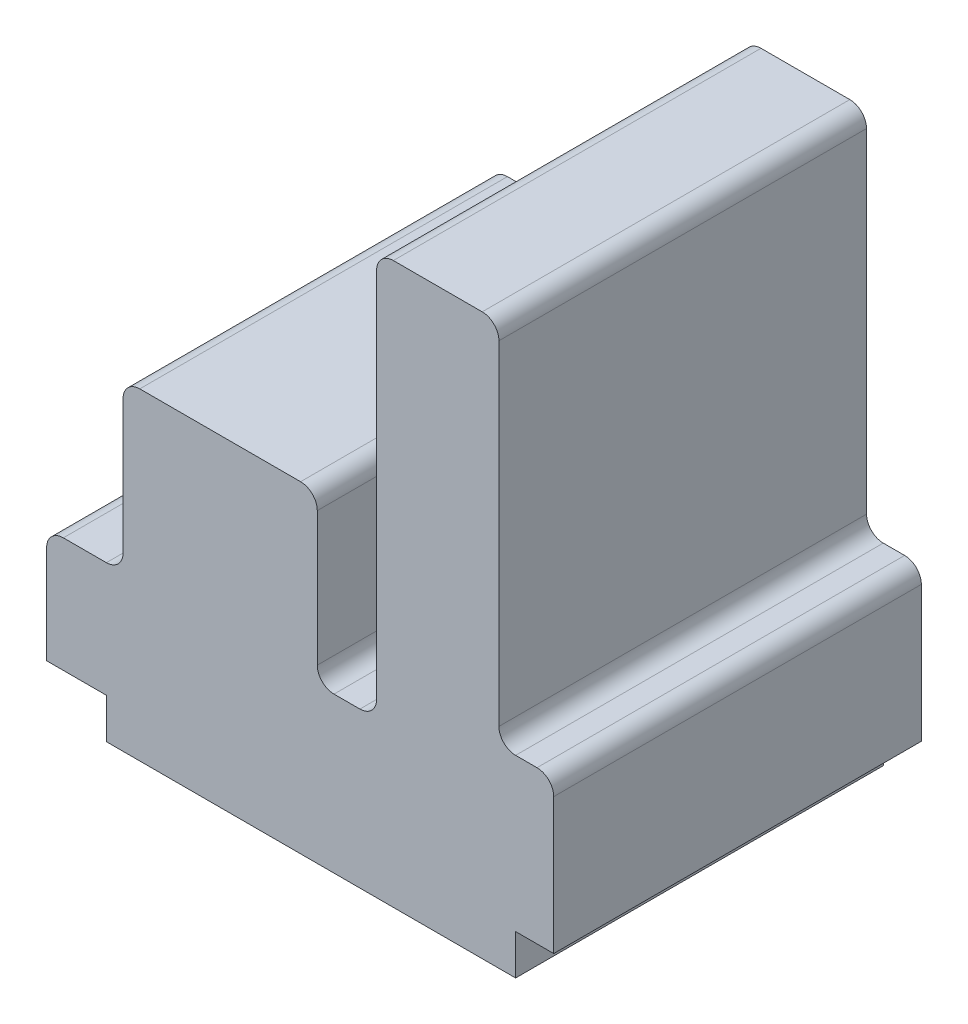
ISO-10303-21;
HEADER;
FILE_DESCRIPTION(('STEP AP214'),'2;1');
FILE_NAME('part.step','',(''),(''),'','','');
FILE_SCHEMA(('AUTOMOTIVE_DESIGN { 1 0 10303 214 1 1 1 1 }'));
ENDSEC;
DATA;
#1=APPLICATION_CONTEXT('core data for automotive mechanical design processes');
#2=APPLICATION_PROTOCOL_DEFINITION('international standard','automotive_design',2000,#1);
#3=PRODUCT_CONTEXT('',#1,'mechanical');
#4=PRODUCT('Part','Part','',(#3));
#5=PRODUCT_RELATED_PRODUCT_CATEGORY('part','',(#4));
#6=PRODUCT_DEFINITION_FORMATION('','',#4);
#7=PRODUCT_DEFINITION_CONTEXT('part definition',#1,'design');
#8=PRODUCT_DEFINITION('design','',#6,#7);
#9=PRODUCT_DEFINITION_SHAPE('','',#8);
#10=(LENGTH_UNIT() NAMED_UNIT(*) SI_UNIT(.MILLI.,.METRE.));
#11=(NAMED_UNIT(*) PLANE_ANGLE_UNIT() SI_UNIT($,.RADIAN.));
#12=(NAMED_UNIT(*) SI_UNIT($,.STERADIAN.) SOLID_ANGLE_UNIT());
#13=UNCERTAINTY_MEASURE_WITH_UNIT(LENGTH_MEASURE(1.E-05),#10,'distance_accuracy_value','');
#14=(GEOMETRIC_REPRESENTATION_CONTEXT(3) GLOBAL_UNCERTAINTY_ASSIGNED_CONTEXT((#13)) GLOBAL_UNIT_ASSIGNED_CONTEXT((#10,
#11,#12)) REPRESENTATION_CONTEXT('',''));
#15=CARTESIAN_POINT('',(0.,0.,0.));
#16=DIRECTION('',(0.,0.,1.));
#17=DIRECTION('',(1.,0.,0.));
#18=AXIS2_PLACEMENT_3D('',#15,#16,#17);
#19=CARTESIAN_POINT('',(0.,7.22031501674547,66.));
#20=DIRECTION('',(0.,1.,0.));
#21=DIRECTION('',(0.,0.,1.));
#22=AXIS2_PLACEMENT_3D('',#19,#20,#21);
#23=PLANE('',#22);
#24=DIRECTION('',(1.,0.,0.));
#25=VECTOR('',#24,1.);
#26=CARTESIAN_POINT('',(0.,7.22031501674547,0.));
#27=LINE('',#26,#25);
#28=CARTESIAN_POINT('',(0.,7.22031501674547,0.));
#29=VERTEX_POINT('',#28);
#30=CARTESIAN_POINT('',(10.7232772940344,7.22031501674547,0.));
#31=VERTEX_POINT('',#30);
#32=EDGE_CURVE('E237',#29,#31,#27,.T.);
#33=ORIENTED_EDGE('',*,*,#32,.T.);
#34=DIRECTION('',(0.,0.,-1.));
#35=VECTOR('',#34,1.);
#36=CARTESIAN_POINT('',(10.7232772940344,7.22031501674547,66.));
#37=LINE('',#36,#35);
#38=CARTESIAN_POINT('',(10.7232772940344,7.22031501674547,66.));
#39=VERTEX_POINT('',#38);
#40=EDGE_CURVE('E11',#39,#31,#37,.T.);
#41=ORIENTED_EDGE('',*,*,#40,.F.);
#42=DIRECTION('',(1.,0.,0.));
#43=VECTOR('',#42,1.);
#44=CARTESIAN_POINT('',(0.,7.22031501674547,66.));
#45=LINE('',#44,#43);
#46=CARTESIAN_POINT('',(0.,7.22031501674547,66.));
#47=VERTEX_POINT('',#46);
#48=EDGE_CURVE('E287',#47,#39,#45,.T.);
#49=ORIENTED_EDGE('',*,*,#48,.F.);
#50=DIRECTION('',(0.,0.,-1.));
#51=VECTOR('',#50,1.);
#52=CARTESIAN_POINT('',(0.,7.22031501674547,66.));
#53=LINE('',#52,#51);
#54=EDGE_CURVE('E233',#47,#29,#53,.T.);
#55=ORIENTED_EDGE('',*,*,#54,.T.);
#56=EDGE_LOOP('',(#33,#41,#49,#55));
#57=FACE_BOUND('',#56,.T.);
#58=ADVANCED_FACE('F33',(#57),#23,.F.);
#59=CARTESIAN_POINT('',(10.7232772940344,7.22031501674547,66.));
#60=DIRECTION('',(1.,0.,0.));
#61=DIRECTION('',(0.,1.,0.));
#62=AXIS2_PLACEMENT_3D('',#59,#60,#61);
#63=PLANE('',#62);
#64=DIRECTION('',(0.,-1.,0.));
#65=VECTOR('',#64,1.);
#66=CARTESIAN_POINT('',(10.7232772940344,7.22031501674547,0.));
#67=LINE('',#66,#65);
#68=CARTESIAN_POINT('',(10.7232772940344,0.,0.));
#69=VERTEX_POINT('',#68);
#70=EDGE_CURVE('E240',#31,#69,#67,.T.);
#71=ORIENTED_EDGE('',*,*,#70,.T.);
#72=DIRECTION('',(0.,0.,-1.));
#73=VECTOR('',#72,1.);
#74=CARTESIAN_POINT('',(10.7232772940344,0.,66.));
#75=LINE('',#74,#73);
#76=CARTESIAN_POINT('',(10.7232772940344,0.,66.));
#77=VERTEX_POINT('',#76);
#78=EDGE_CURVE('E41',#77,#69,#75,.T.);
#79=ORIENTED_EDGE('',*,*,#78,.F.);
#80=DIRECTION('',(0.,-1.,0.));
#81=VECTOR('',#80,1.);
#82=CARTESIAN_POINT('',(10.7232772940344,7.22031501674547,66.));
#83=LINE('',#82,#81);
#84=EDGE_CURVE('E146',#39,#77,#83,.T.);
#85=ORIENTED_EDGE('',*,*,#84,.F.);
#86=ORIENTED_EDGE('',*,*,#40,.T.);
#87=EDGE_LOOP('',(#71,#79,#85,#86));
#88=FACE_BOUND('',#87,.T.);
#89=ADVANCED_FACE('F435',(#88),#63,.F.);
#90=CARTESIAN_POINT('',(10.7232772940344,0.,66.));
#91=DIRECTION('',(0.,1.,0.));
#92=DIRECTION('',(0.,0.,1.));
#93=AXIS2_PLACEMENT_3D('',#90,#91,#92);
#94=PLANE('',#93);
#95=DIRECTION('',(1.,0.,0.));
#96=VECTOR('',#95,1.);
#97=CARTESIAN_POINT('',(10.7232772940344,0.,0.));
#98=LINE('',#97,#96);
#99=CARTESIAN_POINT('',(84.1934052714497,0.,0.));
#100=VERTEX_POINT('',#99);
#101=EDGE_CURVE('E242',#69,#100,#98,.T.);
#102=ORIENTED_EDGE('',*,*,#101,.T.);
#103=DIRECTION('',(0.,0.,-1.));
#104=VECTOR('',#103,1.);
#105=CARTESIAN_POINT('',(84.1934052714497,0.,66.));
#106=LINE('',#105,#104);
#107=CARTESIAN_POINT('',(84.1934052714497,0.,66.));
#108=VERTEX_POINT('',#107);
#109=EDGE_CURVE('E348',#108,#100,#106,.T.);
#110=ORIENTED_EDGE('',*,*,#109,.F.);
#111=DIRECTION('',(1.,0.,0.));
#112=VECTOR('',#111,1.);
#113=CARTESIAN_POINT('',(10.7232772940344,0.,66.));
#114=LINE('',#113,#112);
#115=EDGE_CURVE('E356',#77,#108,#114,.T.);
#116=ORIENTED_EDGE('',*,*,#115,.F.);
#117=ORIENTED_EDGE('',*,*,#78,.T.);
#118=EDGE_LOOP('',(#102,#110,#116,#117));
#119=FACE_BOUND('',#118,.T.);
#120=ADVANCED_FACE('F354',(#119),#94,.F.);
#121=CARTESIAN_POINT('',(84.1934052714498,7.22031501674547,66.));
#122=DIRECTION('',(-1.,0.,0.));
#123=DIRECTION('',(0.,-1.,0.));
#124=AXIS2_PLACEMENT_3D('',#121,#122,#123);
#125=PLANE('',#124);
#126=DIRECTION('',(0.,1.,0.));
#127=VECTOR('',#126,1.);
#128=CARTESIAN_POINT('',(84.1934052714498,7.22031501674547,0.));
#129=LINE('',#128,#127);
#130=CARTESIAN_POINT('',(84.1934052714498,7.22031501674547,0.));
#131=VERTEX_POINT('',#130);
#132=EDGE_CURVE('E244',#100,#131,#129,.T.);
#133=ORIENTED_EDGE('',*,*,#132,.T.);
#134=DIRECTION('',(0.,0.,-1.));
#135=VECTOR('',#134,1.);
#136=CARTESIAN_POINT('',(84.1934052714498,7.22031501674547,66.));
#137=LINE('',#136,#135);
#138=CARTESIAN_POINT('',(84.1934052714498,7.22031501674547,66.));
#139=VERTEX_POINT('',#138);
#140=EDGE_CURVE('E345',#139,#131,#137,.T.);
#141=ORIENTED_EDGE('',*,*,#140,.F.);
#142=DIRECTION('',(0.,1.,0.));
#143=VECTOR('',#142,1.);
#144=CARTESIAN_POINT('',(84.1934052714498,7.22031501674547,66.));
#145=LINE('',#144,#143);
#146=EDGE_CURVE('E374',#108,#139,#145,.T.);
#147=ORIENTED_EDGE('',*,*,#146,.F.);
#148=ORIENTED_EDGE('',*,*,#109,.T.);
#149=EDGE_LOOP('',(#133,#141,#147,#148));
#150=FACE_BOUND('',#149,.T.);
#151=ADVANCED_FACE('F365',(#150),#125,.F.);
#152=CARTESIAN_POINT('',(91.0332621944301,7.22031501674547,66.));
#153=DIRECTION('',(0.,1.,0.));
#154=DIRECTION('',(0.,0.,1.));
#155=AXIS2_PLACEMENT_3D('',#152,#153,#154);
#156=PLANE('',#155);
#157=DIRECTION('',(1.,0.,0.));
#158=VECTOR('',#157,1.);
#159=CARTESIAN_POINT('',(91.0332621944301,7.22031501674547,0.));
#160=LINE('',#159,#158);
#161=CARTESIAN_POINT('',(91.0332621944301,7.22031501674547,0.));
#162=VERTEX_POINT('',#161);
#163=EDGE_CURVE('E246',#131,#162,#160,.T.);
#164=ORIENTED_EDGE('',*,*,#163,.T.);
#165=DIRECTION('',(0.,0.,-1.));
#166=VECTOR('',#165,1.);
#167=CARTESIAN_POINT('',(91.0332621944301,7.22031501674547,66.));
#168=LINE('',#167,#166);
#169=CARTESIAN_POINT('',(91.0332621944301,7.22031501674547,66.));
#170=VERTEX_POINT('',#169);
#171=EDGE_CURVE('E342',#170,#162,#168,.T.);
#172=ORIENTED_EDGE('',*,*,#171,.F.);
#173=DIRECTION('',(1.,0.,0.));
#174=VECTOR('',#173,1.);
#175=CARTESIAN_POINT('',(91.0332621944301,7.22031501674547,66.));
#176=LINE('',#175,#174);
#177=EDGE_CURVE('E371',#139,#170,#176,.T.);
#178=ORIENTED_EDGE('',*,*,#177,.F.);
#179=ORIENTED_EDGE('',*,*,#140,.T.);
#180=EDGE_LOOP('',(#164,#172,#178,#179));
#181=FACE_BOUND('',#180,.T.);
#182=ADVANCED_FACE('F369',(#181),#156,.F.);
#183=CARTESIAN_POINT('',(91.0332621944301,7.22031501674547,66.));
#184=DIRECTION('',(-1.,0.,0.));
#185=DIRECTION('',(0.,0.,1.));
#186=AXIS2_PLACEMENT_3D('',#183,#184,#185);
#187=PLANE('',#186);
#188=DIRECTION('',(0.,1.,0.));
#189=VECTOR('',#188,1.);
#190=CARTESIAN_POINT('',(91.0332621944301,7.22031501674547,0.));
#191=LINE('',#190,#189);
#192=CARTESIAN_POINT('',(91.0332621944301,31.6171970900724,0.));
#193=VERTEX_POINT('',#192);
#194=EDGE_CURVE('E248',#162,#193,#191,.T.);
#195=ORIENTED_EDGE('',*,*,#194,.T.);
#196=DIRECTION('',(0.,0.,-1.));
#197=VECTOR('',#196,1.);
#198=CARTESIAN_POINT('',(91.0332621944301,31.6171970900724,66.));
#199=LINE('',#198,#197);
#200=CARTESIAN_POINT('',(91.0332621944301,31.6171970900724,66.));
#201=VERTEX_POINT('',#200);
#202=EDGE_CURVE('E339',#201,#193,#199,.T.);
#203=ORIENTED_EDGE('',*,*,#202,.F.);
#204=DIRECTION('',(0.,1.,0.));
#205=VECTOR('',#204,1.);
#206=CARTESIAN_POINT('',(91.0332621944301,7.22031501674547,66.));
#207=LINE('',#206,#205);
#208=EDGE_CURVE('E373',#170,#201,#207,.T.);
#209=ORIENTED_EDGE('',*,*,#208,.F.);
#210=ORIENTED_EDGE('',*,*,#171,.T.);
#211=EDGE_LOOP('',(#195,#203,#209,#210));
#212=FACE_BOUND('',#211,.T.);
#213=ADVANCED_FACE('F448',(#212),#187,.F.);
#214=CARTESIAN_POINT('',(88.0332621944301,31.6171970900724,66.));
#215=DIRECTION('',(0.,0.,-1.));
#216=DIRECTION('',(-1.,0.,0.));
#217=AXIS2_PLACEMENT_3D('',#214,#215,#216);
#218=CYLINDRICAL_SURFACE('',#217,3.);
#219=CARTESIAN_POINT('',(88.0332621944301,31.6171970900724,0.));
#220=DIRECTION('',(0.,0.,1.));
#221=DIRECTION('',(-1.,0.,0.));
#222=AXIS2_PLACEMENT_3D('',#219,#220,#221);
#223=CIRCLE('',#222,3.);
#224=CARTESIAN_POINT('',(88.0332621944301,34.6171970900724,0.));
#225=VERTEX_POINT('',#224);
#226=EDGE_CURVE('E250',#193,#225,#223,.T.);
#227=ORIENTED_EDGE('',*,*,#226,.T.);
#228=DIRECTION('',(0.,0.,-1.));
#229=VECTOR('',#228,1.);
#230=CARTESIAN_POINT('',(88.0332621944301,34.6171970900724,66.));
#231=LINE('',#230,#229);
#232=CARTESIAN_POINT('',(88.0332621944301,34.6171970900724,66.));
#233=VERTEX_POINT('',#232);
#234=EDGE_CURVE('E336',#233,#225,#231,.T.);
#235=ORIENTED_EDGE('',*,*,#234,.F.);
#236=CARTESIAN_POINT('',(88.0332621944301,31.6171970900724,66.));
#237=DIRECTION('',(0.,0.,1.));
#238=DIRECTION('',(-1.,0.,0.));
#239=AXIS2_PLACEMENT_3D('',#236,#237,#238);
#240=CIRCLE('',#239,3.);
#241=EDGE_CURVE('E376',#201,#233,#240,.T.);
#242=ORIENTED_EDGE('',*,*,#241,.F.);
#243=ORIENTED_EDGE('',*,*,#202,.T.);
#244=EDGE_LOOP('',(#227,#235,#242,#243));
#245=FACE_BOUND('',#244,.T.);
#246=ADVANCED_FACE('F451',(#245),#218,.T.);
#247=CARTESIAN_POINT('',(84.1934052714498,34.6171970900724,66.));
#248=DIRECTION('',(0.,-1.,0.));
#249=DIRECTION('',(0.,0.,-1.));
#250=AXIS2_PLACEMENT_3D('',#247,#248,#249);
#251=PLANE('',#250);
#252=DIRECTION('',(-1.,0.,0.));
#253=VECTOR('',#252,1.);
#254=CARTESIAN_POINT('',(84.1934052714498,34.6171970900724,0.));
#255=LINE('',#254,#253);
#256=CARTESIAN_POINT('',(84.1934052714498,34.6171970900724,0.));
#257=VERTEX_POINT('',#256);
#258=EDGE_CURVE('E252',#225,#257,#255,.T.);
#259=ORIENTED_EDGE('',*,*,#258,.T.);
#260=DIRECTION('',(0.,0.,-1.));
#261=VECTOR('',#260,1.);
#262=CARTESIAN_POINT('',(84.1934052714498,34.6171970900724,66.));
#263=LINE('',#262,#261);
#264=CARTESIAN_POINT('',(84.1934052714498,34.6171970900724,66.));
#265=VERTEX_POINT('',#264);
#266=EDGE_CURVE('E333',#265,#257,#263,.T.);
#267=ORIENTED_EDGE('',*,*,#266,.F.);
#268=DIRECTION('',(-1.,0.,0.));
#269=VECTOR('',#268,1.);
#270=CARTESIAN_POINT('',(84.1934052714498,34.6171970900724,66.));
#271=LINE('',#270,#269);
#272=EDGE_CURVE('E382',#233,#265,#271,.T.);
#273=ORIENTED_EDGE('',*,*,#272,.F.);
#274=ORIENTED_EDGE('',*,*,#234,.T.);
#275=EDGE_LOOP('',(#259,#267,#273,#274));
#276=FACE_BOUND('',#275,.T.);
#277=ADVANCED_FACE('F455',(#276),#251,.F.);
#278=CARTESIAN_POINT('',(84.1934052714497,37.6171970900724,66.));
#279=DIRECTION('',(0.,0.,-1.));
#280=DIRECTION('',(-1.,0.,0.));
#281=AXIS2_PLACEMENT_3D('',#278,#279,#280);
#282=CYLINDRICAL_SURFACE('',#281,3.);
#283=CARTESIAN_POINT('',(84.1934052714497,37.6171970900724,0.));
#284=DIRECTION('',(0.,0.,-1.));
#285=DIRECTION('',(1.,0.,0.));
#286=AXIS2_PLACEMENT_3D('',#283,#284,#285);
#287=CIRCLE('',#286,3.);
#288=CARTESIAN_POINT('',(81.1934052714497,37.6171970900725,0.));
#289=VERTEX_POINT('',#288);
#290=EDGE_CURVE('E254',#257,#289,#287,.T.);
#291=ORIENTED_EDGE('',*,*,#290,.T.);
#292=DIRECTION('',(0.,0.,-1.));
#293=VECTOR('',#292,1.);
#294=CARTESIAN_POINT('',(81.1934052714497,37.6171970900725,66.));
#295=LINE('',#294,#293);
#296=CARTESIAN_POINT('',(81.1934052714497,37.6171970900725,66.));
#297=VERTEX_POINT('',#296);
#298=EDGE_CURVE('E330',#297,#289,#295,.T.);
#299=ORIENTED_EDGE('',*,*,#298,.F.);
#300=CARTESIAN_POINT('',(84.1934052714497,37.6171970900724,66.));
#301=DIRECTION('',(0.,0.,-1.));
#302=DIRECTION('',(1.,0.,0.));
#303=AXIS2_PLACEMENT_3D('',#300,#301,#302);
#304=CIRCLE('',#303,3.);
#305=EDGE_CURVE('E384',#265,#297,#304,.T.);
#306=ORIENTED_EDGE('',*,*,#305,.F.);
#307=ORIENTED_EDGE('',*,*,#266,.T.);
#308=EDGE_LOOP('',(#291,#299,#306,#307));
#309=FACE_BOUND('',#308,.T.);
#310=ADVANCED_FACE('F459',(#309),#282,.F.);
#311=CARTESIAN_POINT('',(81.1934052714497,97.5716738581848,66.));
#312=DIRECTION('',(-1.,0.,0.));
#313=DIRECTION('',(0.,0.,1.));
#314=AXIS2_PLACEMENT_3D('',#311,#312,#313);
#315=PLANE('',#314);
#316=DIRECTION('',(0.,1.,0.));
#317=VECTOR('',#316,1.);
#318=CARTESIAN_POINT('',(81.1934052714497,97.5716738581848,0.));
#319=LINE('',#318,#317);
#320=CARTESIAN_POINT('',(81.1934052714497,97.5716738581848,0.));
#321=VERTEX_POINT('',#320);
#322=EDGE_CURVE('E256',#289,#321,#319,.T.);
#323=ORIENTED_EDGE('',*,*,#322,.T.);
#324=DIRECTION('',(0.,0.,-1.));
#325=VECTOR('',#324,1.);
#326=CARTESIAN_POINT('',(81.1934052714497,97.5716738581848,66.));
#327=LINE('',#326,#325);
#328=CARTESIAN_POINT('',(81.1934052714497,97.5716738581848,66.));
#329=VERTEX_POINT('',#328);
#330=EDGE_CURVE('E327',#329,#321,#327,.T.);
#331=ORIENTED_EDGE('',*,*,#330,.F.);
#332=DIRECTION('',(0.,1.,0.));
#333=VECTOR('',#332,1.);
#334=CARTESIAN_POINT('',(81.1934052714497,97.5716738581848,66.));
#335=LINE('',#334,#333);
#336=EDGE_CURVE('E386',#297,#329,#335,.T.);
#337=ORIENTED_EDGE('',*,*,#336,.F.);
#338=ORIENTED_EDGE('',*,*,#298,.T.);
#339=EDGE_LOOP('',(#323,#331,#337,#338));
#340=FACE_BOUND('',#339,.T.);
#341=ADVANCED_FACE('F463',(#340),#315,.F.);
#342=CARTESIAN_POINT('',(78.1934052714497,97.5716738581848,66.));
#343=DIRECTION('',(0.,0.,-1.));
#344=DIRECTION('',(-1.,0.,0.));
#345=AXIS2_PLACEMENT_3D('',#342,#343,#344);
#346=CYLINDRICAL_SURFACE('',#345,3.);
#347=CARTESIAN_POINT('',(78.1934052714497,97.5716738581848,0.));
#348=DIRECTION('',(0.,0.,1.));
#349=DIRECTION('',(1.,0.,0.));
#350=AXIS2_PLACEMENT_3D('',#347,#348,#349);
#351=CIRCLE('',#350,3.);
#352=CARTESIAN_POINT('',(78.1934052714497,100.571673858185,0.));
#353=VERTEX_POINT('',#352);
#354=EDGE_CURVE('E258',#321,#353,#351,.T.);
#355=ORIENTED_EDGE('',*,*,#354,.T.);
#356=DIRECTION('',(0.,0.,-1.));
#357=VECTOR('',#356,1.);
#358=CARTESIAN_POINT('',(78.1934052714497,100.571673858185,66.));
#359=LINE('',#358,#357);
#360=CARTESIAN_POINT('',(78.1934052714497,100.571673858185,66.));
#361=VERTEX_POINT('',#360);
#362=EDGE_CURVE('E324',#361,#353,#359,.T.);
#363=ORIENTED_EDGE('',*,*,#362,.F.);
#364=CARTESIAN_POINT('',(78.1934052714497,97.5716738581848,66.));
#365=DIRECTION('',(0.,0.,1.));
#366=DIRECTION('',(1.,0.,0.));
#367=AXIS2_PLACEMENT_3D('',#364,#365,#366);
#368=CIRCLE('',#367,3.);
#369=EDGE_CURVE('E388',#329,#361,#368,.T.);
#370=ORIENTED_EDGE('',*,*,#369,.F.);
#371=ORIENTED_EDGE('',*,*,#330,.T.);
#372=EDGE_LOOP('',(#355,#363,#370,#371));
#373=FACE_BOUND('',#372,.T.);
#374=ADVANCED_FACE('F467',(#373),#346,.T.);
#375=CARTESIAN_POINT('',(62.2414019103769,100.571673858185,66.));
#376=DIRECTION('',(0.,-1.,0.));
#377=DIRECTION('',(1.,0.,0.));
#378=AXIS2_PLACEMENT_3D('',#375,#376,#377);
#379=PLANE('',#378);
#380=DIRECTION('',(-1.,0.,0.));
#381=VECTOR('',#380,1.);
#382=CARTESIAN_POINT('',(62.2414019103769,100.571673858185,0.));
#383=LINE('',#382,#381);
#384=CARTESIAN_POINT('',(62.2414019103769,100.571673858185,0.));
#385=VERTEX_POINT('',#384);
#386=EDGE_CURVE('E260',#353,#385,#383,.T.);
#387=ORIENTED_EDGE('',*,*,#386,.T.);
#388=DIRECTION('',(0.,0.,-1.));
#389=VECTOR('',#388,1.);
#390=CARTESIAN_POINT('',(62.2414019103769,100.571673858185,66.));
#391=LINE('',#390,#389);
#392=CARTESIAN_POINT('',(62.2414019103769,100.571673858185,66.));
#393=VERTEX_POINT('',#392);
#394=EDGE_CURVE('E321',#393,#385,#391,.T.);
#395=ORIENTED_EDGE('',*,*,#394,.F.);
#396=DIRECTION('',(-1.,0.,0.));
#397=VECTOR('',#396,1.);
#398=CARTESIAN_POINT('',(62.2414019103769,100.571673858185,66.));
#399=LINE('',#398,#397);
#400=EDGE_CURVE('E390',#361,#393,#399,.T.);
#401=ORIENTED_EDGE('',*,*,#400,.F.);
#402=ORIENTED_EDGE('',*,*,#362,.T.);
#403=EDGE_LOOP('',(#387,#395,#401,#402));
#404=FACE_BOUND('',#403,.T.);
#405=ADVANCED_FACE('F471',(#404),#379,.F.);
#406=CARTESIAN_POINT('',(62.2414019103769,97.5716738581848,66.));
#407=DIRECTION('',(0.,0.,-1.));
#408=DIRECTION('',(-1.,0.,0.));
#409=AXIS2_PLACEMENT_3D('',#406,#407,#408);
#410=CYLINDRICAL_SURFACE('',#409,3.);
#411=CARTESIAN_POINT('',(62.2414019103769,97.5716738581848,0.));
#412=DIRECTION('',(0.,0.,1.));
#413=DIRECTION('',(-1.,0.,0.));
#414=AXIS2_PLACEMENT_3D('',#411,#412,#413);
#415=CIRCLE('',#414,3.);
#416=CARTESIAN_POINT('',(59.2414019103769,97.5716738581848,0.));
#417=VERTEX_POINT('',#416);
#418=EDGE_CURVE('E262',#385,#417,#415,.T.);
#419=ORIENTED_EDGE('',*,*,#418,.T.);
#420=DIRECTION('',(0.,0.,-1.));
#421=VECTOR('',#420,1.);
#422=CARTESIAN_POINT('',(59.2414019103769,97.5716738581848,66.));
#423=LINE('',#422,#421);
#424=CARTESIAN_POINT('',(59.2414019103769,97.5716738581848,66.));
#425=VERTEX_POINT('',#424);
#426=EDGE_CURVE('E318',#425,#417,#423,.T.);
#427=ORIENTED_EDGE('',*,*,#426,.F.);
#428=CARTESIAN_POINT('',(62.2414019103769,97.5716738581848,66.));
#429=DIRECTION('',(0.,0.,1.));
#430=DIRECTION('',(-1.,0.,0.));
#431=AXIS2_PLACEMENT_3D('',#428,#429,#430);
#432=CIRCLE('',#431,3.);
#433=EDGE_CURVE('E392',#393,#425,#432,.T.);
#434=ORIENTED_EDGE('',*,*,#433,.F.);
#435=ORIENTED_EDGE('',*,*,#394,.T.);
#436=EDGE_LOOP('',(#419,#427,#434,#435));
#437=FACE_BOUND('',#436,.T.);
#438=ADVANCED_FACE('F475',(#437),#410,.T.);
#439=CARTESIAN_POINT('',(59.2414019103769,30.837901934447,66.));
#440=DIRECTION('',(1.,0.,0.));
#441=DIRECTION('',(0.,1.,0.));
#442=AXIS2_PLACEMENT_3D('',#439,#440,#441);
#443=PLANE('',#442);
#444=DIRECTION('',(0.,-1.,0.));
#445=VECTOR('',#444,1.);
#446=CARTESIAN_POINT('',(59.2414019103769,30.837901934447,0.));
#447=LINE('',#446,#445);
#448=CARTESIAN_POINT('',(59.2414019103769,30.837901934447,0.));
#449=VERTEX_POINT('',#448);
#450=EDGE_CURVE('E264',#417,#449,#447,.T.);
#451=ORIENTED_EDGE('',*,*,#450,.T.);
#452=DIRECTION('',(0.,0.,-1.));
#453=VECTOR('',#452,1.);
#454=CARTESIAN_POINT('',(59.2414019103769,30.837901934447,66.));
#455=LINE('',#454,#453);
#456=CARTESIAN_POINT('',(59.2414019103769,30.837901934447,66.));
#457=VERTEX_POINT('',#456);
#458=EDGE_CURVE('E315',#457,#449,#455,.T.);
#459=ORIENTED_EDGE('',*,*,#458,.F.);
#460=DIRECTION('',(0.,-1.,0.));
#461=VECTOR('',#460,1.);
#462=CARTESIAN_POINT('',(59.2414019103769,30.837901934447,66.));
#463=LINE('',#462,#461);
#464=EDGE_CURVE('E394',#425,#457,#463,.T.);
#465=ORIENTED_EDGE('',*,*,#464,.F.);
#466=ORIENTED_EDGE('',*,*,#426,.T.);
#467=EDGE_LOOP('',(#451,#459,#465,#466));
#468=FACE_BOUND('',#467,.T.);
#469=ADVANCED_FACE('F479',(#468),#443,.F.);
#470=CARTESIAN_POINT('',(56.2414019103769,30.837901934447,66.));
#471=DIRECTION('',(0.,0.,-1.));
#472=DIRECTION('',(-1.,0.,0.));
#473=AXIS2_PLACEMENT_3D('',#470,#471,#472);
#474=CYLINDRICAL_SURFACE('',#473,3.);
#475=CARTESIAN_POINT('',(56.2414019103769,30.837901934447,0.));
#476=DIRECTION('',(0.,0.,-1.));
#477=DIRECTION('',(1.,0.,0.));
#478=AXIS2_PLACEMENT_3D('',#475,#476,#477);
#479=CIRCLE('',#478,3.);
#480=CARTESIAN_POINT('',(56.2414019103768,27.837901934447,0.));
#481=VERTEX_POINT('',#480);
#482=EDGE_CURVE('E266',#449,#481,#479,.T.);
#483=ORIENTED_EDGE('',*,*,#482,.T.);
#484=DIRECTION('',(0.,0.,-1.));
#485=VECTOR('',#484,1.);
#486=CARTESIAN_POINT('',(56.2414019103768,27.837901934447,66.));
#487=LINE('',#486,#485);
#488=CARTESIAN_POINT('',(56.2414019103768,27.837901934447,66.));
#489=VERTEX_POINT('',#488);
#490=EDGE_CURVE('E312',#489,#481,#487,.T.);
#491=ORIENTED_EDGE('',*,*,#490,.F.);
#492=CARTESIAN_POINT('',(56.2414019103769,30.837901934447,66.));
#493=DIRECTION('',(0.,0.,-1.));
#494=DIRECTION('',(1.,0.,0.));
#495=AXIS2_PLACEMENT_3D('',#492,#493,#494);
#496=CIRCLE('',#495,3.);
#497=EDGE_CURVE('E396',#457,#489,#496,.T.);
#498=ORIENTED_EDGE('',*,*,#497,.F.);
#499=ORIENTED_EDGE('',*,*,#458,.T.);
#500=EDGE_LOOP('',(#483,#491,#498,#499));
#501=FACE_BOUND('',#500,.T.);
#502=ADVANCED_FACE('F483',(#501),#474,.F.);
#503=CARTESIAN_POINT('',(51.5882238086797,27.837901934447,66.));
#504=DIRECTION('',(0.,-1.,0.));
#505=DIRECTION('',(0.,0.,-1.));
#506=AXIS2_PLACEMENT_3D('',#503,#504,#505);
#507=PLANE('',#506);
#508=DIRECTION('',(-1.,0.,0.));
#509=VECTOR('',#508,1.);
#510=CARTESIAN_POINT('',(51.5882238086797,27.837901934447,0.));
#511=LINE('',#510,#509);
#512=CARTESIAN_POINT('',(51.5882238086797,27.837901934447,0.));
#513=VERTEX_POINT('',#512);
#514=EDGE_CURVE('E268',#481,#513,#511,.T.);
#515=ORIENTED_EDGE('',*,*,#514,.T.);
#516=DIRECTION('',(0.,0.,-1.));
#517=VECTOR('',#516,1.);
#518=CARTESIAN_POINT('',(51.5882238086797,27.837901934447,66.));
#519=LINE('',#518,#517);
#520=CARTESIAN_POINT('',(51.5882238086797,27.837901934447,66.));
#521=VERTEX_POINT('',#520);
#522=EDGE_CURVE('E309',#521,#513,#519,.T.);
#523=ORIENTED_EDGE('',*,*,#522,.F.);
#524=DIRECTION('',(-1.,0.,0.));
#525=VECTOR('',#524,1.);
#526=CARTESIAN_POINT('',(51.5882238086797,27.837901934447,66.));
#527=LINE('',#526,#525);
#528=EDGE_CURVE('E398',#489,#521,#527,.T.);
#529=ORIENTED_EDGE('',*,*,#528,.F.);
#530=ORIENTED_EDGE('',*,*,#490,.T.);
#531=EDGE_LOOP('',(#515,#523,#529,#530));
#532=FACE_BOUND('',#531,.T.);
#533=ADVANCED_FACE('F487',(#532),#507,.F.);
#534=CARTESIAN_POINT('',(51.5882238086797,30.837901934447,66.));
#535=DIRECTION('',(0.,0.,-1.));
#536=DIRECTION('',(-1.,0.,0.));
#537=AXIS2_PLACEMENT_3D('',#534,#535,#536);
#538=CYLINDRICAL_SURFACE('',#537,3.);
#539=CARTESIAN_POINT('',(51.5882238086797,30.837901934447,0.));
#540=DIRECTION('',(0.,0.,-1.));
#541=DIRECTION('',(1.,0.,0.));
#542=AXIS2_PLACEMENT_3D('',#539,#540,#541);
#543=CIRCLE('',#542,3.);
#544=CARTESIAN_POINT('',(48.5882238086797,30.837901934447,0.));
#545=VERTEX_POINT('',#544);
#546=EDGE_CURVE('E270',#513,#545,#543,.T.);
#547=ORIENTED_EDGE('',*,*,#546,.T.);
#548=DIRECTION('',(0.,0.,-1.));
#549=VECTOR('',#548,1.);
#550=CARTESIAN_POINT('',(48.5882238086797,30.837901934447,66.));
#551=LINE('',#550,#549);
#552=CARTESIAN_POINT('',(48.5882238086797,30.837901934447,66.));
#553=VERTEX_POINT('',#552);
#554=EDGE_CURVE('E306',#553,#545,#551,.T.);
#555=ORIENTED_EDGE('',*,*,#554,.F.);
#556=CARTESIAN_POINT('',(51.5882238086797,30.837901934447,66.));
#557=DIRECTION('',(0.,0.,-1.));
#558=DIRECTION('',(1.,0.,0.));
#559=AXIS2_PLACEMENT_3D('',#556,#557,#558);
#560=CIRCLE('',#559,3.);
#561=EDGE_CURVE('E400',#521,#553,#560,.T.);
#562=ORIENTED_EDGE('',*,*,#561,.F.);
#563=ORIENTED_EDGE('',*,*,#522,.T.);
#564=EDGE_LOOP('',(#547,#555,#562,#563));
#565=FACE_BOUND('',#564,.T.);
#566=ADVANCED_FACE('F491',(#565),#538,.F.);
#567=CARTESIAN_POINT('',(48.5882238086797,54.8604947665026,66.));
#568=DIRECTION('',(-1.,0.,0.));
#569=DIRECTION('',(0.,0.,1.));
#570=AXIS2_PLACEMENT_3D('',#567,#568,#569);
#571=PLANE('',#570);
#572=DIRECTION('',(0.,1.,0.));
#573=VECTOR('',#572,1.);
#574=CARTESIAN_POINT('',(48.5882238086797,54.8604947665026,0.));
#575=LINE('',#574,#573);
#576=CARTESIAN_POINT('',(48.5882238086797,54.8604947665026,0.));
#577=VERTEX_POINT('',#576);
#578=EDGE_CURVE('E272',#545,#577,#575,.T.);
#579=ORIENTED_EDGE('',*,*,#578,.T.);
#580=DIRECTION('',(0.,0.,-1.));
#581=VECTOR('',#580,1.);
#582=CARTESIAN_POINT('',(48.5882238086797,54.8604947665026,66.));
#583=LINE('',#582,#581);
#584=CARTESIAN_POINT('',(48.5882238086797,54.8604947665026,66.));
#585=VERTEX_POINT('',#584);
#586=EDGE_CURVE('E303',#585,#577,#583,.T.);
#587=ORIENTED_EDGE('',*,*,#586,.F.);
#588=DIRECTION('',(0.,1.,0.));
#589=VECTOR('',#588,1.);
#590=CARTESIAN_POINT('',(48.5882238086797,54.8604947665026,66.));
#591=LINE('',#590,#589);
#592=EDGE_CURVE('E402',#553,#585,#591,.T.);
#593=ORIENTED_EDGE('',*,*,#592,.F.);
#594=ORIENTED_EDGE('',*,*,#554,.T.);
#595=EDGE_LOOP('',(#579,#587,#593,#594));
#596=FACE_BOUND('',#595,.T.);
#597=ADVANCED_FACE('F495',(#596),#571,.F.);
#598=CARTESIAN_POINT('',(45.5882238086797,54.8604947665026,66.));
#599=DIRECTION('',(0.,0.,-1.));
#600=DIRECTION('',(-1.,0.,0.));
#601=AXIS2_PLACEMENT_3D('',#598,#599,#600);
#602=CYLINDRICAL_SURFACE('',#601,3.);
#603=CARTESIAN_POINT('',(45.5882238086797,54.8604947665026,0.));
#604=DIRECTION('',(0.,0.,1.));
#605=DIRECTION('',(-1.,0.,0.));
#606=AXIS2_PLACEMENT_3D('',#603,#604,#605);
#607=CIRCLE('',#606,3.);
#608=CARTESIAN_POINT('',(45.5882238086797,57.8604947665026,0.));
#609=VERTEX_POINT('',#608);
#610=EDGE_CURVE('E274',#577,#609,#607,.T.);
#611=ORIENTED_EDGE('',*,*,#610,.T.);
#612=DIRECTION('',(0.,0.,-1.));
#613=VECTOR('',#612,1.);
#614=CARTESIAN_POINT('',(45.5882238086797,57.8604947665026,66.));
#615=LINE('',#614,#613);
#616=CARTESIAN_POINT('',(45.5882238086797,57.8604947665026,66.));
#617=VERTEX_POINT('',#616);
#618=EDGE_CURVE('E300',#617,#609,#615,.T.);
#619=ORIENTED_EDGE('',*,*,#618,.F.);
#620=CARTESIAN_POINT('',(45.5882238086797,54.8604947665026,66.));
#621=DIRECTION('',(0.,0.,1.));
#622=DIRECTION('',(-1.,0.,0.));
#623=AXIS2_PLACEMENT_3D('',#620,#621,#622);
#624=CIRCLE('',#623,3.);
#625=EDGE_CURVE('E404',#585,#617,#624,.T.);
#626=ORIENTED_EDGE('',*,*,#625,.F.);
#627=ORIENTED_EDGE('',*,*,#586,.T.);
#628=EDGE_LOOP('',(#611,#619,#626,#627));
#629=FACE_BOUND('',#628,.T.);
#630=ADVANCED_FACE('F499',(#629),#602,.T.);
#631=CARTESIAN_POINT('',(16.7232772940345,57.8604947665026,66.));
#632=DIRECTION('',(0.,-1.,0.));
#633=DIRECTION('',(0.,0.,-1.));
#634=AXIS2_PLACEMENT_3D('',#631,#632,#633);
#635=PLANE('',#634);
#636=DIRECTION('',(-1.,0.,0.));
#637=VECTOR('',#636,1.);
#638=CARTESIAN_POINT('',(16.7232772940345,57.8604947665026,0.));
#639=LINE('',#638,#637);
#640=CARTESIAN_POINT('',(16.7232772940345,57.8604947665026,0.));
#641=VERTEX_POINT('',#640);
#642=EDGE_CURVE('E276',#609,#641,#639,.T.);
#643=ORIENTED_EDGE('',*,*,#642,.T.);
#644=DIRECTION('',(0.,0.,-1.));
#645=VECTOR('',#644,1.);
#646=CARTESIAN_POINT('',(16.7232772940345,57.8604947665026,66.));
#647=LINE('',#646,#645);
#648=CARTESIAN_POINT('',(16.7232772940345,57.8604947665026,66.));
#649=VERTEX_POINT('',#648);
#650=EDGE_CURVE('E297',#649,#641,#647,.T.);
#651=ORIENTED_EDGE('',*,*,#650,.F.);
#652=DIRECTION('',(-1.,0.,0.));
#653=VECTOR('',#652,1.);
#654=CARTESIAN_POINT('',(16.7232772940345,57.8604947665026,66.));
#655=LINE('',#654,#653);
#656=EDGE_CURVE('E406',#617,#649,#655,.T.);
#657=ORIENTED_EDGE('',*,*,#656,.F.);
#658=ORIENTED_EDGE('',*,*,#618,.T.);
#659=EDGE_LOOP('',(#643,#651,#657,#658));
#660=FACE_BOUND('',#659,.T.);
#661=ADVANCED_FACE('F503',(#660),#635,.F.);
#662=CARTESIAN_POINT('',(16.7232772940345,54.8604947665026,66.));
#663=DIRECTION('',(0.,0.,-1.));
#664=DIRECTION('',(-1.,0.,0.));
#665=AXIS2_PLACEMENT_3D('',#662,#663,#664);
#666=CYLINDRICAL_SURFACE('',#665,3.);
#667=CARTESIAN_POINT('',(16.7232772940345,54.8604947665026,0.));
#668=DIRECTION('',(0.,0.,1.));
#669=DIRECTION('',(-1.,0.,0.));
#670=AXIS2_PLACEMENT_3D('',#667,#668,#669);
#671=CIRCLE('',#670,3.);
#672=CARTESIAN_POINT('',(13.7232772940345,54.8604947665026,0.));
#673=VERTEX_POINT('',#672);
#674=EDGE_CURVE('E278',#641,#673,#671,.T.);
#675=ORIENTED_EDGE('',*,*,#674,.T.);
#676=DIRECTION('',(0.,0.,-1.));
#677=VECTOR('',#676,1.);
#678=CARTESIAN_POINT('',(13.7232772940345,54.8604947665026,66.));
#679=LINE('',#678,#677);
#680=CARTESIAN_POINT('',(13.7232772940345,54.8604947665026,66.));
#681=VERTEX_POINT('',#680);
#682=EDGE_CURVE('E294',#681,#673,#679,.T.);
#683=ORIENTED_EDGE('',*,*,#682,.F.);
#684=CARTESIAN_POINT('',(16.7232772940345,54.8604947665026,66.));
#685=DIRECTION('',(0.,0.,1.));
#686=DIRECTION('',(-1.,0.,0.));
#687=AXIS2_PLACEMENT_3D('',#684,#685,#686);
#688=CIRCLE('',#687,3.);
#689=EDGE_CURVE('E408',#649,#681,#688,.T.);
#690=ORIENTED_EDGE('',*,*,#689,.F.);
#691=ORIENTED_EDGE('',*,*,#650,.T.);
#692=EDGE_LOOP('',(#675,#683,#690,#691));
#693=FACE_BOUND('',#692,.T.);
#694=ADVANCED_FACE('F507',(#693),#666,.T.);
#695=CARTESIAN_POINT('',(13.7232772940345,30.837901934447,66.));
#696=DIRECTION('',(1.,0.,0.));
#697=DIRECTION('',(0.,0.,-1.));
#698=AXIS2_PLACEMENT_3D('',#695,#696,#697);
#699=PLANE('',#698);
#700=DIRECTION('',(0.,-1.,0.));
#701=VECTOR('',#700,1.);
#702=CARTESIAN_POINT('',(13.7232772940345,30.837901934447,0.));
#703=LINE('',#702,#701);
#704=CARTESIAN_POINT('',(13.7232772940345,30.837901934447,0.));
#705=VERTEX_POINT('',#704);
#706=EDGE_CURVE('E280',#673,#705,#703,.T.);
#707=ORIENTED_EDGE('',*,*,#706,.T.);
#708=DIRECTION('',(0.,0.,-1.));
#709=VECTOR('',#708,1.);
#710=CARTESIAN_POINT('',(13.7232772940345,30.837901934447,66.));
#711=LINE('',#710,#709);
#712=CARTESIAN_POINT('',(13.7232772940345,30.837901934447,66.));
#713=VERTEX_POINT('',#712);
#714=EDGE_CURVE('E291',#713,#705,#711,.T.);
#715=ORIENTED_EDGE('',*,*,#714,.F.);
#716=DIRECTION('',(0.,-1.,0.));
#717=VECTOR('',#716,1.);
#718=CARTESIAN_POINT('',(13.7232772940345,30.837901934447,66.));
#719=LINE('',#718,#717);
#720=EDGE_CURVE('E410',#681,#713,#719,.T.);
#721=ORIENTED_EDGE('',*,*,#720,.F.);
#722=ORIENTED_EDGE('',*,*,#682,.T.);
#723=EDGE_LOOP('',(#707,#715,#721,#722));
#724=FACE_BOUND('',#723,.T.);
#725=ADVANCED_FACE('F416',(#724),#699,.F.);
#726=CARTESIAN_POINT('',(10.7232772940345,30.837901934447,66.));
#727=DIRECTION('',(0.,0.,-1.));
#728=DIRECTION('',(-1.,0.,0.));
#729=AXIS2_PLACEMENT_3D('',#726,#727,#728);
#730=CYLINDRICAL_SURFACE('',#729,3.);
#731=CARTESIAN_POINT('',(10.7232772940345,30.837901934447,0.));
#732=DIRECTION('',(0.,0.,-1.));
#733=DIRECTION('',(1.,0.,0.));
#734=AXIS2_PLACEMENT_3D('',#731,#732,#733);
#735=CIRCLE('',#734,3.);
#736=CARTESIAN_POINT('',(10.7232772940344,27.837901934447,0.));
#737=VERTEX_POINT('',#736);
#738=EDGE_CURVE('E282',#705,#737,#735,.T.);
#739=ORIENTED_EDGE('',*,*,#738,.T.);
#740=DIRECTION('',(0.,0.,-1.));
#741=VECTOR('',#740,1.);
#742=CARTESIAN_POINT('',(10.7232772940344,27.837901934447,66.));
#743=LINE('',#742,#741);
#744=CARTESIAN_POINT('',(10.7232772940344,27.837901934447,66.));
#745=VERTEX_POINT('',#744);
#746=EDGE_CURVE('E228',#745,#737,#743,.T.);
#747=ORIENTED_EDGE('',*,*,#746,.F.);
#748=CARTESIAN_POINT('',(10.7232772940345,30.837901934447,66.));
#749=DIRECTION('',(0.,0.,-1.));
#750=DIRECTION('',(1.,0.,0.));
#751=AXIS2_PLACEMENT_3D('',#748,#749,#750);
#752=CIRCLE('',#751,3.);
#753=EDGE_CURVE('E219',#713,#745,#752,.T.);
#754=ORIENTED_EDGE('',*,*,#753,.F.);
#755=ORIENTED_EDGE('',*,*,#714,.T.);
#756=EDGE_LOOP('',(#739,#747,#754,#755));
#757=FACE_BOUND('',#756,.T.);
#758=ADVANCED_FACE('F420',(#757),#730,.F.);
#759=CARTESIAN_POINT('',(3.00000000000002,27.837901934447,66.));
#760=DIRECTION('',(0.,-1.,0.));
#761=DIRECTION('',(0.,0.,-1.));
#762=AXIS2_PLACEMENT_3D('',#759,#760,#761);
#763=PLANE('',#762);
#764=DIRECTION('',(-1.,0.,0.));
#765=VECTOR('',#764,1.);
#766=CARTESIAN_POINT('',(3.00000000000002,27.837901934447,0.));
#767=LINE('',#766,#765);
#768=CARTESIAN_POINT('',(3.00000000000002,27.837901934447,0.));
#769=VERTEX_POINT('',#768);
#770=EDGE_CURVE('E227',#737,#769,#767,.T.);
#771=ORIENTED_EDGE('',*,*,#770,.T.);
#772=DIRECTION('',(0.,0.,-1.));
#773=VECTOR('',#772,1.);
#774=CARTESIAN_POINT('',(3.00000000000002,27.837901934447,66.));
#775=LINE('',#774,#773);
#776=CARTESIAN_POINT('',(3.00000000000002,27.837901934447,66.));
#777=VERTEX_POINT('',#776);
#778=EDGE_CURVE('E224',#777,#769,#775,.T.);
#779=ORIENTED_EDGE('',*,*,#778,.F.);
#780=DIRECTION('',(-1.,0.,0.));
#781=VECTOR('',#780,1.);
#782=CARTESIAN_POINT('',(3.00000000000002,27.837901934447,66.));
#783=LINE('',#782,#781);
#784=EDGE_CURVE('E213',#745,#777,#783,.T.);
#785=ORIENTED_EDGE('',*,*,#784,.F.);
#786=ORIENTED_EDGE('',*,*,#746,.T.);
#787=EDGE_LOOP('',(#771,#779,#785,#786));
#788=FACE_BOUND('',#787,.T.);
#789=ADVANCED_FACE('F225',(#788),#763,.F.);
#790=CARTESIAN_POINT('',(3.,24.837901934447,66.));
#791=DIRECTION('',(0.,0.,-1.));
#792=DIRECTION('',(-1.,0.,0.));
#793=AXIS2_PLACEMENT_3D('',#790,#791,#792);
#794=CYLINDRICAL_SURFACE('',#793,3.);
#795=CARTESIAN_POINT('',(3.,24.837901934447,0.));
#796=DIRECTION('',(0.,0.,1.));
#797=DIRECTION('',(1.,0.,0.));
#798=AXIS2_PLACEMENT_3D('',#795,#796,#797);
#799=CIRCLE('',#798,3.);
#800=CARTESIAN_POINT('',(0.,24.8379019344469,0.));
#801=VERTEX_POINT('',#800);
#802=EDGE_CURVE('E132',#769,#801,#799,.T.);
#803=ORIENTED_EDGE('',*,*,#802,.T.);
#804=DIRECTION('',(0.,0.,-1.));
#805=VECTOR('',#804,1.);
#806=CARTESIAN_POINT('',(0.,24.8379019344469,66.));
#807=LINE('',#806,#805);
#808=CARTESIAN_POINT('',(0.,24.8379019344469,66.));
#809=VERTEX_POINT('',#808);
#810=EDGE_CURVE('E229',#809,#801,#807,.T.);
#811=ORIENTED_EDGE('',*,*,#810,.F.);
#812=CARTESIAN_POINT('',(3.,24.837901934447,66.));
#813=DIRECTION('',(0.,0.,1.));
#814=DIRECTION('',(1.,0.,0.));
#815=AXIS2_PLACEMENT_3D('',#812,#813,#814);
#816=CIRCLE('',#815,3.);
#817=EDGE_CURVE('E217',#777,#809,#816,.T.);
#818=ORIENTED_EDGE('',*,*,#817,.F.);
#819=ORIENTED_EDGE('',*,*,#778,.T.);
#820=EDGE_LOOP('',(#803,#811,#818,#819));
#821=FACE_BOUND('',#820,.T.);
#822=ADVANCED_FACE('F231',(#821),#794,.T.);
#823=CARTESIAN_POINT('',(0.,7.22031501674547,66.));
#824=DIRECTION('',(1.,0.,0.));
#825=DIRECTION('',(0.,0.,-1.));
#826=AXIS2_PLACEMENT_3D('',#823,#824,#825);
#827=PLANE('',#826);
#828=DIRECTION('',(0.,-1.,0.));
#829=VECTOR('',#828,1.);
#830=CARTESIAN_POINT('',(0.,7.22031501674547,0.));
#831=LINE('',#830,#829);
#832=EDGE_CURVE('E138',#801,#29,#831,.T.);
#833=ORIENTED_EDGE('',*,*,#832,.T.);
#834=ORIENTED_EDGE('',*,*,#54,.F.);
#835=DIRECTION('',(0.,-1.,0.));
#836=VECTOR('',#835,1.);
#837=CARTESIAN_POINT('',(0.,7.22031501674547,66.));
#838=LINE('',#837,#836);
#839=EDGE_CURVE('E49',#809,#47,#838,.T.);
#840=ORIENTED_EDGE('',*,*,#839,.F.);
#841=ORIENTED_EDGE('',*,*,#810,.T.);
#842=EDGE_LOOP('',(#833,#834,#840,#841));
#843=FACE_BOUND('',#842,.T.);
#844=ADVANCED_FACE('F424',(#843),#827,.F.);
#845=CARTESIAN_POINT('',(88.0332621944301,31.6171970900724,66.));
#846=DIRECTION('',(0.,0.,-1.));
#847=DIRECTION('',(-1.,0.,0.));
#848=AXIS2_PLACEMENT_3D('',#845,#846,#847);
#849=PLANE('',#848);
#850=ORIENTED_EDGE('',*,*,#48,.T.);
#851=ORIENTED_EDGE('',*,*,#84,.T.);
#852=ORIENTED_EDGE('',*,*,#115,.T.);
#853=ORIENTED_EDGE('',*,*,#146,.T.);
#854=ORIENTED_EDGE('',*,*,#177,.T.);
#855=ORIENTED_EDGE('',*,*,#208,.T.);
#856=ORIENTED_EDGE('',*,*,#241,.T.);
#857=ORIENTED_EDGE('',*,*,#272,.T.);
#858=ORIENTED_EDGE('',*,*,#305,.T.);
#859=ORIENTED_EDGE('',*,*,#336,.T.);
#860=ORIENTED_EDGE('',*,*,#369,.T.);
#861=ORIENTED_EDGE('',*,*,#400,.T.);
#862=ORIENTED_EDGE('',*,*,#433,.T.);
#863=ORIENTED_EDGE('',*,*,#464,.T.);
#864=ORIENTED_EDGE('',*,*,#497,.T.);
#865=ORIENTED_EDGE('',*,*,#528,.T.);
#866=ORIENTED_EDGE('',*,*,#561,.T.);
#867=ORIENTED_EDGE('',*,*,#592,.T.);
#868=ORIENTED_EDGE('',*,*,#625,.T.);
#869=ORIENTED_EDGE('',*,*,#656,.T.);
#870=ORIENTED_EDGE('',*,*,#689,.T.);
#871=ORIENTED_EDGE('',*,*,#720,.T.);
#872=ORIENTED_EDGE('',*,*,#753,.T.);
#873=ORIENTED_EDGE('',*,*,#784,.T.);
#874=ORIENTED_EDGE('',*,*,#817,.T.);
#875=ORIENTED_EDGE('',*,*,#839,.T.);
#876=EDGE_LOOP('',(#850,#851,#852,#853,#854,#855,#856,#857,#858,#859,#860,#861,#862,#863,#864,
#865,#866,#867,#868,#869,#870,#871,#872,#873,#874,#875));
#877=FACE_BOUND('',#876,.T.);
#878=ADVANCED_FACE('F215',(#877),#849,.F.);
#879=CARTESIAN_POINT('',(88.0332621944301,31.6171970900724,0.));
#880=DIRECTION('',(0.,0.,-1.));
#881=DIRECTION('',(-1.,0.,0.));
#882=AXIS2_PLACEMENT_3D('',#879,#880,#881);
#883=PLANE('',#882);
#884=ORIENTED_EDGE('',*,*,#32,.F.);
#885=ORIENTED_EDGE('',*,*,#832,.F.);
#886=ORIENTED_EDGE('',*,*,#802,.F.);
#887=ORIENTED_EDGE('',*,*,#770,.F.);
#888=ORIENTED_EDGE('',*,*,#738,.F.);
#889=ORIENTED_EDGE('',*,*,#706,.F.);
#890=ORIENTED_EDGE('',*,*,#674,.F.);
#891=ORIENTED_EDGE('',*,*,#642,.F.);
#892=ORIENTED_EDGE('',*,*,#610,.F.);
#893=ORIENTED_EDGE('',*,*,#578,.F.);
#894=ORIENTED_EDGE('',*,*,#546,.F.);
#895=ORIENTED_EDGE('',*,*,#514,.F.);
#896=ORIENTED_EDGE('',*,*,#482,.F.);
#897=ORIENTED_EDGE('',*,*,#450,.F.);
#898=ORIENTED_EDGE('',*,*,#418,.F.);
#899=ORIENTED_EDGE('',*,*,#386,.F.);
#900=ORIENTED_EDGE('',*,*,#354,.F.);
#901=ORIENTED_EDGE('',*,*,#322,.F.);
#902=ORIENTED_EDGE('',*,*,#290,.F.);
#903=ORIENTED_EDGE('',*,*,#258,.F.);
#904=ORIENTED_EDGE('',*,*,#226,.F.);
#905=ORIENTED_EDGE('',*,*,#194,.F.);
#906=ORIENTED_EDGE('',*,*,#163,.F.);
#907=ORIENTED_EDGE('',*,*,#132,.F.);
#908=ORIENTED_EDGE('',*,*,#101,.F.);
#909=ORIENTED_EDGE('',*,*,#70,.F.);
#910=EDGE_LOOP('',(#884,#885,#886,#887,#888,#889,#890,#891,#892,#893,#894,#895,#896,#897,#898,
#899,#900,#901,#902,#903,#904,#905,#906,#907,#908,#909));
#911=FACE_BOUND('',#910,.T.);
#912=ADVANCED_FACE('F360',(#911),#883,.T.);
#913=CLOSED_SHELL('',(#58,#89,#120,#151,#182,#213,#246,#277,#310,#341,#374,#405,#438,#469,#502,
#533,#566,#597,#630,#661,#694,#725,#758,#789,#822,#844,#878,#912));
#914=MANIFOLD_SOLID_BREP('B2',#913);
#915=ADVANCED_BREP_SHAPE_REPRESENTATION('',(#18,#914),#14);
#916=SHAPE_DEFINITION_REPRESENTATION(#9,#915);
ENDSEC;
END-ISO-10303-21;
